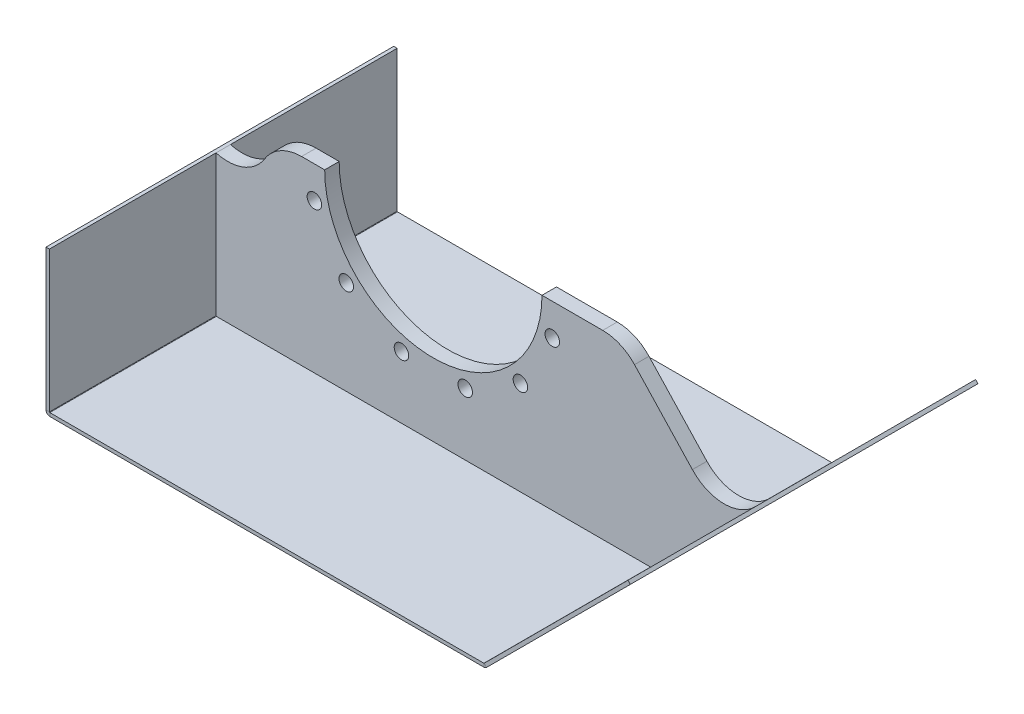
ISO-10303-21;
HEADER;
FILE_DESCRIPTION(('STEP AP214'),'2;1');
FILE_NAME('part.step','',(''),(''),'','','');
FILE_SCHEMA(('AUTOMOTIVE_DESIGN { 1 0 10303 214 1 1 1 1 }'));
ENDSEC;
DATA;
#1=APPLICATION_CONTEXT('core data for automotive mechanical design processes');
#2=APPLICATION_PROTOCOL_DEFINITION('international standard','automotive_design',2000,#1);
#3=PRODUCT_CONTEXT('',#1,'mechanical');
#4=PRODUCT('Part','Part','',(#3));
#5=PRODUCT_RELATED_PRODUCT_CATEGORY('part','',(#4));
#6=PRODUCT_DEFINITION_FORMATION('','',#4);
#7=PRODUCT_DEFINITION_CONTEXT('part definition',#1,'design');
#8=PRODUCT_DEFINITION('design','',#6,#7);
#9=PRODUCT_DEFINITION_SHAPE('','',#8);
#10=(LENGTH_UNIT() NAMED_UNIT(*) SI_UNIT(.MILLI.,.METRE.));
#11=(NAMED_UNIT(*) PLANE_ANGLE_UNIT() SI_UNIT($,.RADIAN.));
#12=(NAMED_UNIT(*) SI_UNIT($,.STERADIAN.) SOLID_ANGLE_UNIT());
#13=UNCERTAINTY_MEASURE_WITH_UNIT(LENGTH_MEASURE(1.E-05),#10,'distance_accuracy_value','');
#14=(GEOMETRIC_REPRESENTATION_CONTEXT(3) GLOBAL_UNCERTAINTY_ASSIGNED_CONTEXT((#13)) GLOBAL_UNIT_ASSIGNED_CONTEXT((#10,
#11,#12)) REPRESENTATION_CONTEXT('',''));
#15=CARTESIAN_POINT('',(0.,0.,0.));
#16=DIRECTION('',(0.,0.,1.));
#17=DIRECTION('',(1.,0.,0.));
#18=AXIS2_PLACEMENT_3D('',#15,#16,#17);
#19=CARTESIAN_POINT('',(0.,0.,25.4));
#20=DIRECTION('',(0.,0.,1.));
#21=DIRECTION('',(1.,0.,0.));
#22=AXIS2_PLACEMENT_3D('',#19,#20,#21);
#23=PLANE('',#22);
#24=CARTESIAN_POINT('',(-152.664354058159,-152.66435405818,25.4));
#25=DIRECTION('',(0.,0.,1.));
#26=DIRECTION('',(1.,0.,0.));
#27=AXIS2_PLACEMENT_3D('',#24,#25,#26);
#28=CIRCLE('',#27,12.7);
#29=CARTESIAN_POINT('',(-139.964354058159,-152.66435405818,25.4));
#30=VERTEX_POINT('',#29);
#31=EDGE_CURVE('E295',#30,#30,#28,.T.);
#32=ORIENTED_EDGE('',*,*,#31,.F.);
#33=EDGE_LOOP('',(#32));
#34=FACE_BOUND('',#33,.T.);
#35=CARTESIAN_POINT('',(55.8790318376513,-208.543385895805,25.4));
#36=DIRECTION('',(0.,0.,1.));
#37=DIRECTION('',(1.,0.,0.));
#38=AXIS2_PLACEMENT_3D('',#35,#36,#37);
#39=CIRCLE('',#38,12.7);
#40=CARTESIAN_POINT('',(68.5790318376513,-208.543385895805,25.4));
#41=VERTEX_POINT('',#40);
#42=EDGE_CURVE('E307',#41,#41,#39,.T.);
#43=ORIENTED_EDGE('',*,*,#42,.F.);
#44=EDGE_LOOP('',(#43));
#45=FACE_BOUND('',#44,.T.);
#46=CARTESIAN_POINT('',(208.543385895819,-55.8790318376252,25.4));
#47=DIRECTION('',(0.,0.,1.));
#48=DIRECTION('',(1.,0.,0.));
#49=AXIS2_PLACEMENT_3D('',#46,#47,#48);
#50=CIRCLE('',#49,12.7);
#51=CARTESIAN_POINT('',(221.243385895819,-55.8790318376252,25.4));
#52=VERTEX_POINT('',#51);
#53=EDGE_CURVE('E230',#52,#52,#50,.T.);
#54=ORIENTED_EDGE('',*,*,#53,.F.);
#55=EDGE_LOOP('',(#54));
#56=FACE_BOUND('',#55,.T.);
#57=CARTESIAN_POINT('',(152.664354058189,-152.664354058168,25.4));
#58=DIRECTION('',(0.,0.,1.));
#59=DIRECTION('',(1.,0.,0.));
#60=AXIS2_PLACEMENT_3D('',#57,#58,#59);
#61=CIRCLE('',#60,12.7);
#62=CARTESIAN_POINT('',(165.364354058189,-152.664354058168,25.4));
#63=VERTEX_POINT('',#62);
#64=EDGE_CURVE('E313',#63,#63,#61,.T.);
#65=ORIENTED_EDGE('',*,*,#64,.F.);
#66=EDGE_LOOP('',(#65));
#67=FACE_BOUND('',#66,.T.);
#68=CARTESIAN_POINT('',(-55.879031837616,-208.54338589581,25.4));
#69=DIRECTION('',(0.,0.,1.));
#70=DIRECTION('',(1.,0.,0.));
#71=AXIS2_PLACEMENT_3D('',#68,#69,#70);
#72=CIRCLE('',#71,12.7);
#73=CARTESIAN_POINT('',(-43.179031837616,-208.54338589581,25.4));
#74=VERTEX_POINT('',#73);
#75=EDGE_CURVE('E301',#74,#74,#72,.T.);
#76=ORIENTED_EDGE('',*,*,#75,.F.);
#77=EDGE_LOOP('',(#76));
#78=FACE_BOUND('',#77,.T.);
#79=CARTESIAN_POINT('',(-208.543385895796,-55.8790318376421,25.4));
#80=DIRECTION('',(0.,0.,1.));
#81=DIRECTION('',(1.,0.,0.));
#82=AXIS2_PLACEMENT_3D('',#79,#80,#81);
#83=CIRCLE('',#82,12.7);
#84=CARTESIAN_POINT('',(-195.843385895796,-55.8790318376421,25.4));
#85=VERTEX_POINT('',#84);
#86=EDGE_CURVE('E289',#85,#85,#83,.T.);
#87=ORIENTED_EDGE('',*,*,#86,.F.);
#88=EDGE_LOOP('',(#87));
#89=FACE_BOUND('',#88,.T.);
#90=DIRECTION('',(1.,0.,0.));
#91=VECTOR('',#90,1.);
#92=CARTESIAN_POINT('',(0.,0.,25.4));
#93=LINE('',#92,#91);
#94=CARTESIAN_POINT('',(-230.964431893917,0.,25.4));
#95=VERTEX_POINT('',#94);
#96=CARTESIAN_POINT('',(-190.5,0.,25.4));
#97=VERTEX_POINT('',#96);
#98=EDGE_CURVE('E376',#95,#97,#93,.T.);
#99=ORIENTED_EDGE('',*,*,#98,.F.);
#100=CARTESIAN_POINT('',(-230.964431893917,-76.2,25.4));
#101=DIRECTION('',(0.,0.,1.));
#102=DIRECTION('',(1.,0.,0.));
#103=AXIS2_PLACEMENT_3D('',#100,#101,#102);
#104=CIRCLE('',#103,76.2);
#105=CARTESIAN_POINT('',(-295.784522163989,-36.1400961386608,25.4));
#106=VERTEX_POINT('',#105);
#107=EDGE_CURVE('E259',#95,#106,#104,.T.);
#108=ORIENTED_EDGE('',*,*,#107,.T.);
#109=CARTESIAN_POINT('',(-360.60461243406,3.9198077226785,25.4));
#110=DIRECTION('',(0.,0.,1.));
#111=DIRECTION('',(1.,0.,0.));
#112=AXIS2_PLACEMENT_3D('',#109,#110,#111);
#113=CIRCLE('',#112,76.2);
#114=CARTESIAN_POINT('',(-381.000000000001,-69.5,25.4));
#115=VERTEX_POINT('',#114);
#116=EDGE_CURVE('E246',#106,#115,#113,.F.);
#117=ORIENTED_EDGE('',*,*,#116,.T.);
#118=DIRECTION('',(0.,1.,0.));
#119=VECTOR('',#118,1.);
#120=CARTESIAN_POINT('',(-381.,0.,25.4));
#121=LINE('',#120,#119);
#122=CARTESIAN_POINT('',(-381.,-316.7634,25.4));
#123=VERTEX_POINT('',#122);
#124=EDGE_CURVE('E280',#123,#115,#121,.T.);
#125=ORIENTED_EDGE('',*,*,#124,.F.);
#126=CARTESIAN_POINT('',(-380.2634,-316.7634,25.4));
#127=DIRECTION('',(0.,0.,1.));
#128=DIRECTION('',(1.,0.,0.));
#129=AXIS2_PLACEMENT_3D('',#126,#127,#128);
#130=CIRCLE('',#129,0.736599999999976);
#131=CARTESIAN_POINT('',(-380.2634,-317.5,25.4));
#132=VERTEX_POINT('',#131);
#133=EDGE_CURVE('E518',#123,#132,#130,.T.);
#134=ORIENTED_EDGE('',*,*,#133,.T.);
#135=DIRECTION('',(-1.,0.,0.));
#136=VECTOR('',#135,1.);
#137=CARTESIAN_POINT('',(0.,-317.5,25.4));
#138=LINE('',#137,#136);
#139=CARTESIAN_POINT('',(380.694890289956,-317.5,25.3999999999998));
#140=VERTEX_POINT('',#139);
#141=EDGE_CURVE('E277',#140,#132,#138,.T.);
#142=ORIENTED_EDGE('',*,*,#141,.F.);
#143=CARTESIAN_POINT('',(380.694890289956,-316.7634,25.4));
#144=DIRECTION('',(0.,0.,1.));
#145=DIRECTION('',(1.,0.,0.));
#146=AXIS2_PLACEMENT_3D('',#143,#144,#145);
#147=CIRCLE('',#146,0.736600000000042);
#148=CARTESIAN_POINT('',(381.215745144978,-317.284254855022,25.3999999999999));
#149=VERTEX_POINT('',#148);
#150=EDGE_CURVE('E513',#140,#149,#147,.T.);
#151=ORIENTED_EDGE('',*,*,#150,.T.);
#152=DIRECTION('',(-0.707106781186551,-0.707106781186544,0.));
#153=VECTOR('',#152,1.);
#154=CARTESIAN_POINT('',(349.249999999998,-349.250000000002,25.4));
#155=LINE('',#154,#153);
#156=CARTESIAN_POINT('',(563.760699338223,-134.739300661779,25.4));
#157=VERTEX_POINT('',#156);
#158=EDGE_CURVE('E509',#157,#149,#155,.T.);
#159=ORIENTED_EDGE('',*,*,#158,.F.);
#160=CARTESIAN_POINT('',(509.879162611808,-80.857763935364,25.4));
#161=DIRECTION('',(0.,0.,1.));
#162=DIRECTION('',(1.,0.,0.));
#163=AXIS2_PLACEMENT_3D('',#160,#161,#162);
#164=CIRCLE('',#163,76.2);
#165=CARTESIAN_POINT('',(454.18285844208,-132.861241721307,25.4));
#166=VERTEX_POINT('',#165);
#167=EDGE_CURVE('E251',#157,#166,#164,.F.);
#168=ORIENTED_EDGE('',*,*,#167,.T.);
#169=DIRECTION('',(0.682460338398204,-0.730922626899325,0.));
#170=VECTOR('',#169,1.);
#171=CARTESIAN_POINT('',(176.371629870807,164.677679655487,25.4));
#172=LINE('',#171,#170);
#173=CARTESIAN_POINT('',(352.72292476694,-24.1965222140569,25.4));
#174=VERTEX_POINT('',#173);
#175=EDGE_CURVE('E270',#174,#166,#172,.T.);
#176=ORIENTED_EDGE('',*,*,#175,.F.);
#177=CARTESIAN_POINT('',(297.026620597212,-76.2,25.4));
#178=DIRECTION('',(0.,0.,1.));
#179=DIRECTION('',(1.,0.,0.));
#180=AXIS2_PLACEMENT_3D('',#177,#178,#179);
#181=CIRCLE('',#180,76.2);
#182=CARTESIAN_POINT('',(297.026620597212,0.,25.4));
#183=VERTEX_POINT('',#182);
#184=EDGE_CURVE('E257',#174,#183,#181,.T.);
#185=ORIENTED_EDGE('',*,*,#184,.T.);
#186=DIRECTION('',(-1.,0.,0.));
#187=VECTOR('',#186,1.);
#188=CARTESIAN_POINT('',(0.,0.,25.4));
#189=LINE('',#188,#187);
#190=CARTESIAN_POINT('',(190.5,0.,25.4));
#191=VERTEX_POINT('',#190);
#192=EDGE_CURVE('E373',#183,#191,#189,.T.);
#193=ORIENTED_EDGE('',*,*,#192,.T.);
#194=CARTESIAN_POINT('',(0.,0.,25.4));
#195=DIRECTION('',(0.,0.,1.));
#196=DIRECTION('',(1.,0.,0.));
#197=AXIS2_PLACEMENT_3D('',#194,#195,#196);
#198=CIRCLE('',#197,190.5);
#199=EDGE_CURVE('E223',#97,#191,#198,.T.);
#200=ORIENTED_EDGE('',*,*,#199,.F.);
#201=EDGE_LOOP('',(#99,#108,#117,#125,#134,#142,#151,#159,#168,#176,#185,#193,#200));
#202=FACE_BOUND('',#201,.T.);
#203=ADVANCED_FACE('F45',(#34,#45,#56,#67,#78,#89,#202),#23,.T.);
#204=CARTESIAN_POINT('',(0.,0.,0.));
#205=DIRECTION('',(0.,0.,1.));
#206=DIRECTION('',(1.,0.,0.));
#207=AXIS2_PLACEMENT_3D('',#204,#205,#206);
#208=PLANE('',#207);
#209=CARTESIAN_POINT('',(-208.543385895796,-55.8790318376421,0.));
#210=DIRECTION('',(0.,0.,1.));
#211=DIRECTION('',(1.,0.,0.));
#212=AXIS2_PLACEMENT_3D('',#209,#210,#211);
#213=CIRCLE('',#212,12.7);
#214=CARTESIAN_POINT('',(-195.843385895796,-55.8790318376421,0.));
#215=VERTEX_POINT('',#214);
#216=EDGE_CURVE('E288',#215,#215,#213,.T.);
#217=ORIENTED_EDGE('',*,*,#216,.T.);
#218=EDGE_LOOP('',(#217));
#219=FACE_BOUND('',#218,.T.);
#220=CARTESIAN_POINT('',(-152.664354058159,-152.66435405818,0.));
#221=DIRECTION('',(0.,0.,1.));
#222=DIRECTION('',(1.,0.,0.));
#223=AXIS2_PLACEMENT_3D('',#220,#221,#222);
#224=CIRCLE('',#223,12.7);
#225=CARTESIAN_POINT('',(-139.964354058159,-152.66435405818,0.));
#226=VERTEX_POINT('',#225);
#227=EDGE_CURVE('E292',#226,#226,#224,.T.);
#228=ORIENTED_EDGE('',*,*,#227,.T.);
#229=EDGE_LOOP('',(#228));
#230=FACE_BOUND('',#229,.T.);
#231=CARTESIAN_POINT('',(-55.879031837616,-208.54338589581,0.));
#232=DIRECTION('',(0.,0.,1.));
#233=DIRECTION('',(1.,0.,0.));
#234=AXIS2_PLACEMENT_3D('',#231,#232,#233);
#235=CIRCLE('',#234,12.7);
#236=CARTESIAN_POINT('',(-43.179031837616,-208.54338589581,0.));
#237=VERTEX_POINT('',#236);
#238=EDGE_CURVE('E298',#237,#237,#235,.T.);
#239=ORIENTED_EDGE('',*,*,#238,.T.);
#240=EDGE_LOOP('',(#239));
#241=FACE_BOUND('',#240,.T.);
#242=CARTESIAN_POINT('',(55.8790318376513,-208.543385895805,0.));
#243=DIRECTION('',(0.,0.,1.));
#244=DIRECTION('',(1.,0.,0.));
#245=AXIS2_PLACEMENT_3D('',#242,#243,#244);
#246=CIRCLE('',#245,12.7);
#247=CARTESIAN_POINT('',(68.5790318376513,-208.543385895805,0.));
#248=VERTEX_POINT('',#247);
#249=EDGE_CURVE('E304',#248,#248,#246,.T.);
#250=ORIENTED_EDGE('',*,*,#249,.T.);
#251=EDGE_LOOP('',(#250));
#252=FACE_BOUND('',#251,.T.);
#253=CARTESIAN_POINT('',(152.664354058189,-152.664354058168,0.));
#254=DIRECTION('',(0.,0.,1.));
#255=DIRECTION('',(1.,0.,0.));
#256=AXIS2_PLACEMENT_3D('',#253,#254,#255);
#257=CIRCLE('',#256,12.7);
#258=CARTESIAN_POINT('',(165.364354058189,-152.664354058168,0.));
#259=VERTEX_POINT('',#258);
#260=EDGE_CURVE('E310',#259,#259,#257,.T.);
#261=ORIENTED_EDGE('',*,*,#260,.T.);
#262=EDGE_LOOP('',(#261));
#263=FACE_BOUND('',#262,.T.);
#264=CARTESIAN_POINT('',(208.543385895819,-55.8790318376252,0.));
#265=DIRECTION('',(0.,0.,1.));
#266=DIRECTION('',(1.,0.,0.));
#267=AXIS2_PLACEMENT_3D('',#264,#265,#266);
#268=CIRCLE('',#267,12.7);
#269=CARTESIAN_POINT('',(221.243385895819,-55.8790318376252,0.));
#270=VERTEX_POINT('',#269);
#271=EDGE_CURVE('E235',#270,#270,#268,.T.);
#272=ORIENTED_EDGE('',*,*,#271,.T.);
#273=EDGE_LOOP('',(#272));
#274=FACE_BOUND('',#273,.T.);
#275=CARTESIAN_POINT('',(-360.60461243406,3.9198077226785,0.));
#276=DIRECTION('',(0.,0.,1.));
#277=DIRECTION('',(1.,0.,0.));
#278=AXIS2_PLACEMENT_3D('',#275,#276,#277);
#279=CIRCLE('',#278,76.2);
#280=CARTESIAN_POINT('',(-381.000000000001,-69.5,0.));
#281=VERTEX_POINT('',#280);
#282=CARTESIAN_POINT('',(-295.784522163989,-36.1400961386608,0.));
#283=VERTEX_POINT('',#282);
#284=EDGE_CURVE('E244',#281,#283,#279,.T.);
#285=ORIENTED_EDGE('',*,*,#284,.T.);
#286=CARTESIAN_POINT('',(-230.964431893917,-76.2,0.));
#287=DIRECTION('',(0.,0.,1.));
#288=DIRECTION('',(1.,0.,0.));
#289=AXIS2_PLACEMENT_3D('',#286,#287,#288);
#290=CIRCLE('',#289,76.2);
#291=CARTESIAN_POINT('',(-230.964431893917,0.,0.));
#292=VERTEX_POINT('',#291);
#293=EDGE_CURVE('E264',#283,#292,#290,.F.);
#294=ORIENTED_EDGE('',*,*,#293,.T.);
#295=DIRECTION('',(-1.,0.,0.));
#296=VECTOR('',#295,1.);
#297=CARTESIAN_POINT('',(0.,0.,0.));
#298=LINE('',#297,#296);
#299=CARTESIAN_POINT('',(-190.5,0.,0.));
#300=VERTEX_POINT('',#299);
#301=EDGE_CURVE('E215',#300,#292,#298,.T.);
#302=ORIENTED_EDGE('',*,*,#301,.F.);
#303=CARTESIAN_POINT('',(0.,0.,0.));
#304=DIRECTION('',(0.,0.,1.));
#305=DIRECTION('',(1.,0.,0.));
#306=AXIS2_PLACEMENT_3D('',#303,#304,#305);
#307=CIRCLE('',#306,190.5);
#308=CARTESIAN_POINT('',(190.5,0.,0.));
#309=VERTEX_POINT('',#308);
#310=EDGE_CURVE('E221',#300,#309,#307,.T.);
#311=ORIENTED_EDGE('',*,*,#310,.T.);
#312=DIRECTION('',(1.,0.,0.));
#313=VECTOR('',#312,1.);
#314=CARTESIAN_POINT('',(0.,0.,0.));
#315=LINE('',#314,#313);
#316=CARTESIAN_POINT('',(297.026620597212,0.,0.));
#317=VERTEX_POINT('',#316);
#318=EDGE_CURVE('E209',#309,#317,#315,.T.);
#319=ORIENTED_EDGE('',*,*,#318,.T.);
#320=CARTESIAN_POINT('',(297.026620597212,-76.2,0.));
#321=DIRECTION('',(0.,0.,1.));
#322=DIRECTION('',(1.,0.,0.));
#323=AXIS2_PLACEMENT_3D('',#320,#321,#322);
#324=CIRCLE('',#323,76.2);
#325=CARTESIAN_POINT('',(352.72292476694,-24.1965222140569,0.));
#326=VERTEX_POINT('',#325);
#327=EDGE_CURVE('E60',#317,#326,#324,.F.);
#328=ORIENTED_EDGE('',*,*,#327,.T.);
#329=DIRECTION('',(0.682460338398204,-0.730922626899325,0.));
#330=VECTOR('',#329,1.);
#331=CARTESIAN_POINT('',(176.371629870807,164.677679655487,0.));
#332=LINE('',#331,#330);
#333=CARTESIAN_POINT('',(454.18285844208,-132.861241721307,0.));
#334=VERTEX_POINT('',#333);
#335=EDGE_CURVE('E271',#326,#334,#332,.T.);
#336=ORIENTED_EDGE('',*,*,#335,.T.);
#337=CARTESIAN_POINT('',(509.879162611808,-80.857763935364,0.));
#338=DIRECTION('',(0.,0.,1.));
#339=DIRECTION('',(1.,0.,0.));
#340=AXIS2_PLACEMENT_3D('',#337,#338,#339);
#341=CIRCLE('',#340,76.2);
#342=CARTESIAN_POINT('',(563.760699338223,-134.739300661779,0.));
#343=VERTEX_POINT('',#342);
#344=EDGE_CURVE('E248',#334,#343,#341,.T.);
#345=ORIENTED_EDGE('',*,*,#344,.T.);
#346=DIRECTION('',(-0.707106781186551,-0.707106781186544,0.));
#347=VECTOR('',#346,1.);
#348=CARTESIAN_POINT('',(349.249999999998,-349.250000000002,0.));
#349=LINE('',#348,#347);
#350=CARTESIAN_POINT('',(381.215745144978,-317.284254855022,-1.11022302462516E-13));
#351=VERTEX_POINT('',#350);
#352=EDGE_CURVE('E502',#343,#351,#349,.T.);
#353=ORIENTED_EDGE('',*,*,#352,.T.);
#354=CARTESIAN_POINT('',(380.694890289956,-316.7634,0.));
#355=DIRECTION('',(0.,0.,1.));
#356=DIRECTION('',(1.,0.,0.));
#357=AXIS2_PLACEMENT_3D('',#354,#355,#356);
#358=CIRCLE('',#357,0.736600000000042);
#359=CARTESIAN_POINT('',(380.694890289956,-317.5,-2.22044604925031E-13));
#360=VERTEX_POINT('',#359);
#361=EDGE_CURVE('E511',#360,#351,#358,.T.);
#362=ORIENTED_EDGE('',*,*,#361,.F.);
#363=DIRECTION('',(-1.,0.,0.));
#364=VECTOR('',#363,1.);
#365=CARTESIAN_POINT('',(0.,-317.5,0.));
#366=LINE('',#365,#364);
#367=CARTESIAN_POINT('',(-380.2634,-317.5,0.));
#368=VERTEX_POINT('',#367);
#369=EDGE_CURVE('E282',#360,#368,#366,.T.);
#370=ORIENTED_EDGE('',*,*,#369,.T.);
#371=CARTESIAN_POINT('',(-380.2634,-316.7634,0.));
#372=DIRECTION('',(0.,0.,1.));
#373=DIRECTION('',(1.,0.,0.));
#374=AXIS2_PLACEMENT_3D('',#371,#372,#373);
#375=CIRCLE('',#374,0.736599999999976);
#376=CARTESIAN_POINT('',(-381.,-316.7634,0.));
#377=VERTEX_POINT('',#376);
#378=EDGE_CURVE('E516',#377,#368,#375,.T.);
#379=ORIENTED_EDGE('',*,*,#378,.F.);
#380=DIRECTION('',(0.,1.,0.));
#381=VECTOR('',#380,1.);
#382=CARTESIAN_POINT('',(-381.,0.,0.));
#383=LINE('',#382,#381);
#384=EDGE_CURVE('E278',#377,#281,#383,.T.);
#385=ORIENTED_EDGE('',*,*,#384,.T.);
#386=EDGE_LOOP('',(#285,#294,#302,#311,#319,#328,#336,#345,#353,#362,#370,#379,#385));
#387=FACE_BOUND('',#386,.T.);
#388=ADVANCED_FACE('F228',(#219,#230,#241,#252,#263,#274,#387),#208,.F.);
#389=CARTESIAN_POINT('',(0.,0.,25.4));
#390=DIRECTION('',(0.,0.,-1.));
#391=DIRECTION('',(-1.,0.,0.));
#392=AXIS2_PLACEMENT_3D('',#389,#390,#391);
#393=CYLINDRICAL_SURFACE('',#392,190.5);
#394=ORIENTED_EDGE('',*,*,#199,.T.);
#395=DIRECTION('',(0.,0.,-1.));
#396=VECTOR('',#395,1.);
#397=CARTESIAN_POINT('',(190.5,0.,317.5));
#398=LINE('',#397,#396);
#399=EDGE_CURVE('E212',#191,#309,#398,.T.);
#400=ORIENTED_EDGE('',*,*,#399,.T.);
#401=ORIENTED_EDGE('',*,*,#310,.F.);
#402=DIRECTION('',(0.,0.,-1.));
#403=VECTOR('',#402,1.);
#404=CARTESIAN_POINT('',(-190.5,0.,317.5));
#405=LINE('',#404,#403);
#406=EDGE_CURVE('E224',#97,#300,#405,.T.);
#407=ORIENTED_EDGE('',*,*,#406,.F.);
#408=EDGE_LOOP('',(#394,#400,#401,#407));
#409=FACE_BOUND('',#408,.T.);
#410=ADVANCED_FACE('F219',(#409),#393,.F.);
#411=CARTESIAN_POINT('',(176.371629870807,164.677679655487,25.4));
#412=DIRECTION('',(0.730922626899325,0.682460338398204,0.));
#413=DIRECTION('',(-0.682460338398204,0.730922626899325,0.));
#414=AXIS2_PLACEMENT_3D('',#411,#412,#413);
#415=PLANE('',#414);
#416=ORIENTED_EDGE('',*,*,#335,.F.);
#417=DIRECTION('',(0.,0.,1.));
#418=VECTOR('',#417,1.);
#419=CARTESIAN_POINT('',(352.72292476694,-24.1965222140568,25.4));
#420=LINE('',#419,#418);
#421=EDGE_CURVE('E53',#326,#174,#420,.T.);
#422=ORIENTED_EDGE('',*,*,#421,.T.);
#423=ORIENTED_EDGE('',*,*,#175,.T.);
#424=DIRECTION('',(0.,0.,-1.));
#425=VECTOR('',#424,1.);
#426=CARTESIAN_POINT('',(454.18285844208,-132.861241721307,0.));
#427=LINE('',#426,#425);
#428=EDGE_CURVE('E232',#166,#334,#427,.T.);
#429=ORIENTED_EDGE('',*,*,#428,.T.);
#430=EDGE_LOOP('',(#416,#422,#423,#429));
#431=FACE_BOUND('',#430,.T.);
#432=ADVANCED_FACE('F269',(#431),#415,.T.);
#433=CARTESIAN_POINT('',(-381.000000000001,-1.36449991091028E-12,0.));
#434=DIRECTION('',(1.,0.,0.));
#435=DIRECTION('',(0.,1.,0.));
#436=AXIS2_PLACEMENT_3D('',#433,#434,#435);
#437=PLANE('',#436);
#438=DIRECTION('',(0.,0.,-1.));
#439=VECTOR('',#438,1.);
#440=CARTESIAN_POINT('',(-381.000000000001,-69.5,-292.1));
#441=LINE('',#440,#439);
#442=CARTESIAN_POINT('',(-381.000000000001,-69.5,-292.1));
#443=VERTEX_POINT('',#442);
#444=EDGE_CURVE('E401',#281,#443,#441,.T.);
#445=ORIENTED_EDGE('',*,*,#444,.F.);
#446=ORIENTED_EDGE('',*,*,#384,.F.);
#447=DIRECTION('',(0.,0.,1.));
#448=VECTOR('',#447,1.);
#449=CARTESIAN_POINT('',(-381.,-316.7634,-292.1));
#450=LINE('',#449,#448);
#451=CARTESIAN_POINT('',(-381.,-316.7634,-292.1));
#452=VERTEX_POINT('',#451);
#453=EDGE_CURVE('E379',#452,#377,#450,.T.);
#454=ORIENTED_EDGE('',*,*,#453,.F.);
#455=DIRECTION('',(0.,-1.,0.));
#456=VECTOR('',#455,1.);
#457=CARTESIAN_POINT('',(-381.,-317.5,-292.1));
#458=LINE('',#457,#456);
#459=EDGE_CURVE('E394',#443,#452,#458,.T.);
#460=ORIENTED_EDGE('',*,*,#459,.F.);
#461=EDGE_LOOP('',(#445,#446,#454,#460));
#462=FACE_BOUND('',#461,.T.);
#463=ADVANCED_FACE('F608',(#462),#437,.T.);
#464=CARTESIAN_POINT('',(0.,-317.5,0.));
#465=DIRECTION('',(0.,-1.,0.));
#466=DIRECTION('',(0.,0.,-1.));
#467=AXIS2_PLACEMENT_3D('',#464,#465,#466);
#468=PLANE('',#467);
#469=DIRECTION('',(0.,0.,1.));
#470=VECTOR('',#469,1.);
#471=CARTESIAN_POINT('',(-380.2634,-317.5,317.5));
#472=LINE('',#471,#470);
#473=CARTESIAN_POINT('',(-380.2634,-317.5,-292.1));
#474=VERTEX_POINT('',#473);
#475=EDGE_CURVE('E430',#368,#474,#472,.F.);
#476=ORIENTED_EDGE('',*,*,#475,.F.);
#477=ORIENTED_EDGE('',*,*,#369,.F.);
#478=DIRECTION('',(0.,0.,-1.));
#479=VECTOR('',#478,1.);
#480=CARTESIAN_POINT('',(380.694890289956,-317.5,-292.1));
#481=LINE('',#480,#479);
#482=CARTESIAN_POINT('',(380.694890289956,-317.5,-292.1));
#483=VERTEX_POINT('',#482);
#484=EDGE_CURVE('E484',#483,#360,#481,.F.);
#485=ORIENTED_EDGE('',*,*,#484,.F.);
#486=DIRECTION('',(-1.,0.,0.));
#487=VECTOR('',#486,1.);
#488=CARTESIAN_POINT('',(-381.,-317.5,-292.1));
#489=LINE('',#488,#487);
#490=EDGE_CURVE('E493',#483,#474,#489,.T.);
#491=ORIENTED_EDGE('',*,*,#490,.T.);
#492=EDGE_LOOP('',(#476,#477,#485,#491));
#493=FACE_BOUND('',#492,.T.);
#494=ADVANCED_FACE('F527',(#493),#468,.F.);
#495=CARTESIAN_POINT('',(-380.2634,-316.7634,317.5));
#496=DIRECTION('',(0.,0.,1.));
#497=DIRECTION('',(-1.,0.,0.));
#498=AXIS2_PLACEMENT_3D('',#495,#496,#497);
#499=CYLINDRICAL_SURFACE('',#498,0.736599999999976);
#500=ORIENTED_EDGE('',*,*,#453,.T.);
#501=ORIENTED_EDGE('',*,*,#378,.T.);
#502=ORIENTED_EDGE('',*,*,#475,.T.);
#503=CARTESIAN_POINT('',(-380.2634,-316.7634,-292.1));
#504=DIRECTION('',(0.,0.,1.));
#505=DIRECTION('',(1.,0.,0.));
#506=AXIS2_PLACEMENT_3D('',#503,#504,#505);
#507=CIRCLE('',#506,0.736599999999976);
#508=EDGE_CURVE('E424',#474,#452,#507,.F.);
#509=ORIENTED_EDGE('',*,*,#508,.T.);
#510=EDGE_LOOP('',(#500,#501,#502,#509));
#511=FACE_BOUND('',#510,.T.);
#512=ADVANCED_FACE('F610',(#511),#499,.F.);
#513=CARTESIAN_POINT('',(380.694890289956,-316.7634,-292.1));
#514=DIRECTION('',(0.,0.,-1.));
#515=DIRECTION('',(0.707106781186544,-0.707106781186551,0.));
#516=AXIS2_PLACEMENT_3D('',#513,#514,#515);
#517=CYLINDRICAL_SURFACE('',#516,0.736600000000042);
#518=ORIENTED_EDGE('',*,*,#484,.T.);
#519=ORIENTED_EDGE('',*,*,#361,.T.);
#520=DIRECTION('',(0.,0.,-1.));
#521=VECTOR('',#520,1.);
#522=CARTESIAN_POINT('',(381.215745144978,-317.284254855022,317.5));
#523=LINE('',#522,#521);
#524=CARTESIAN_POINT('',(381.215745144978,-317.284254855022,-292.1));
#525=VERTEX_POINT('',#524);
#526=EDGE_CURVE('E443',#351,#525,#523,.T.);
#527=ORIENTED_EDGE('',*,*,#526,.T.);
#528=CARTESIAN_POINT('',(380.694890289956,-316.7634,-292.1));
#529=DIRECTION('',(0.,0.,-1.));
#530=DIRECTION('',(-1.,0.,0.));
#531=AXIS2_PLACEMENT_3D('',#528,#529,#530);
#532=CIRCLE('',#531,0.736600000000042);
#533=EDGE_CURVE('E470',#525,#483,#532,.T.);
#534=ORIENTED_EDGE('',*,*,#533,.T.);
#535=EDGE_LOOP('',(#518,#519,#527,#534));
#536=FACE_BOUND('',#535,.T.);
#537=ADVANCED_FACE('F530',(#536),#517,.F.);
#538=CARTESIAN_POINT('',(0.,-323.5,0.));
#539=DIRECTION('',(0.,-1.,0.));
#540=DIRECTION('',(0.,0.,-1.));
#541=AXIS2_PLACEMENT_3D('',#538,#539,#540);
#542=PLANE('',#541);
#543=DIRECTION('',(1.,0.,0.));
#544=VECTOR('',#543,1.);
#545=CARTESIAN_POINT('',(-381.,-323.5,317.5));
#546=LINE('',#545,#544);
#547=CARTESIAN_POINT('',(-380.2634,-323.5,317.5));
#548=VERTEX_POINT('',#547);
#549=CARTESIAN_POINT('',(380.694890289956,-323.5,317.5));
#550=VERTEX_POINT('',#549);
#551=EDGE_CURVE('E499',#548,#550,#546,.T.);
#552=ORIENTED_EDGE('',*,*,#551,.F.);
#553=DIRECTION('',(0.,0.,1.));
#554=VECTOR('',#553,1.);
#555=CARTESIAN_POINT('',(-380.2634,-323.5,317.5));
#556=LINE('',#555,#554);
#557=CARTESIAN_POINT('',(-380.2634,-323.5,-292.1));
#558=VERTEX_POINT('',#557);
#559=EDGE_CURVE('E414',#548,#558,#556,.F.);
#560=ORIENTED_EDGE('',*,*,#559,.T.);
#561=DIRECTION('',(-1.,0.,0.));
#562=VECTOR('',#561,1.);
#563=CARTESIAN_POINT('',(-381.,-323.5,-292.1));
#564=LINE('',#563,#562);
#565=CARTESIAN_POINT('',(380.694890289956,-323.5,-292.1));
#566=VERTEX_POINT('',#565);
#567=EDGE_CURVE('E496',#566,#558,#564,.T.);
#568=ORIENTED_EDGE('',*,*,#567,.F.);
#569=DIRECTION('',(0.,0.,-1.));
#570=VECTOR('',#569,1.);
#571=CARTESIAN_POINT('',(380.694890289956,-323.5,-292.1));
#572=LINE('',#571,#570);
#573=EDGE_CURVE('E471',#566,#550,#572,.F.);
#574=ORIENTED_EDGE('',*,*,#573,.T.);
#575=EDGE_LOOP('',(#552,#560,#568,#574));
#576=FACE_BOUND('',#575,.T.);
#577=ADVANCED_FACE('F568',(#576),#542,.T.);
#578=ORIENTED_EDGE('',*,*,#141,.T.);
#579=CARTESIAN_POINT('',(-380.2634,-317.5,317.5));
#580=VERTEX_POINT('',#579);
#581=EDGE_CURVE('E427',#580,#132,#472,.F.);
#582=ORIENTED_EDGE('',*,*,#581,.F.);
#583=DIRECTION('',(1.,0.,0.));
#584=VECTOR('',#583,1.);
#585=CARTESIAN_POINT('',(-381.,-317.5,317.5));
#586=LINE('',#585,#584);
#587=CARTESIAN_POINT('',(380.694890289956,-317.5,317.499999999999));
#588=VERTEX_POINT('',#587);
#589=EDGE_CURVE('E500',#580,#588,#586,.T.);
#590=ORIENTED_EDGE('',*,*,#589,.T.);
#591=EDGE_CURVE('E487',#140,#588,#481,.F.);
#592=ORIENTED_EDGE('',*,*,#591,.F.);
#593=EDGE_LOOP('',(#578,#582,#590,#592));
#594=FACE_BOUND('',#593,.T.);
#595=ADVANCED_FACE('F586',(#594),#468,.F.);
#596=CARTESIAN_POINT('',(-381.,-323.5,317.5));
#597=DIRECTION('',(0.,0.,1.));
#598=DIRECTION('',(1.,0.,0.));
#599=AXIS2_PLACEMENT_3D('',#596,#597,#598);
#600=PLANE('',#599);
#601=ORIENTED_EDGE('',*,*,#589,.F.);
#602=DIRECTION('',(0.,-1.,0.));
#603=VECTOR('',#602,1.);
#604=CARTESIAN_POINT('',(-380.2634,-317.5,317.5));
#605=LINE('',#604,#603);
#606=EDGE_CURVE('E421',#580,#548,#605,.T.);
#607=ORIENTED_EDGE('',*,*,#606,.T.);
#608=ORIENTED_EDGE('',*,*,#551,.T.);
#609=DIRECTION('',(0.,-1.,3.01445295852595E-13));
#610=VECTOR('',#609,1.);
#611=CARTESIAN_POINT('',(380.694890289956,-317.5,317.499999999999));
#612=LINE('',#611,#610);
#613=EDGE_CURVE('E490',#588,#550,#612,.T.);
#614=ORIENTED_EDGE('',*,*,#613,.F.);
#615=EDGE_LOOP('',(#601,#607,#608,#614));
#616=FACE_BOUND('',#615,.T.);
#617=ADVANCED_FACE('F582',(#616),#600,.T.);
#618=CARTESIAN_POINT('',(-381.,-323.5,-292.1));
#619=DIRECTION('',(0.,0.,-1.));
#620=DIRECTION('',(-1.,0.,0.));
#621=AXIS2_PLACEMENT_3D('',#618,#619,#620);
#622=PLANE('',#621);
#623=DIRECTION('',(0.,-1.,0.));
#624=VECTOR('',#623,1.);
#625=CARTESIAN_POINT('',(-380.2634,-317.5,-292.1));
#626=LINE('',#625,#624);
#627=EDGE_CURVE('E433',#474,#558,#626,.T.);
#628=ORIENTED_EDGE('',*,*,#627,.F.);
#629=ORIENTED_EDGE('',*,*,#490,.F.);
#630=DIRECTION('',(0.,-1.,0.));
#631=VECTOR('',#630,1.);
#632=CARTESIAN_POINT('',(380.694890289956,-317.5,-292.1));
#633=LINE('',#632,#631);
#634=EDGE_CURVE('E478',#483,#566,#633,.T.);
#635=ORIENTED_EDGE('',*,*,#634,.T.);
#636=ORIENTED_EDGE('',*,*,#567,.T.);
#637=EDGE_LOOP('',(#628,#629,#635,#636));
#638=FACE_BOUND('',#637,.T.);
#639=ADVANCED_FACE('F571',(#638),#622,.T.);
#640=CARTESIAN_POINT('',(380.694890289956,-316.7634,317.5));
#641=DIRECTION('',(0.,0.,1.));
#642=DIRECTION('',(1.,0.,0.));
#643=AXIS2_PLACEMENT_3D('',#640,#641,#642);
#644=PLANE('',#643);
#645=DIRECTION('',(0.707106781186544,-0.707106781186551,0.));
#646=VECTOR('',#645,1.);
#647=CARTESIAN_POINT('',(381.215745144978,-317.284254855022,317.5));
#648=LINE('',#647,#646);
#649=CARTESIAN_POINT('',(381.215745144978,-317.284254855022,317.499999999999));
#650=VERTEX_POINT('',#649);
#651=CARTESIAN_POINT('',(385.458385832097,-321.526895542142,317.499999999999));
#652=VERTEX_POINT('',#651);
#653=EDGE_CURVE('E436',#650,#652,#648,.T.);
#654=ORIENTED_EDGE('',*,*,#653,.F.);
#655=CARTESIAN_POINT('',(380.694890289956,-316.7634,317.5));
#656=DIRECTION('',(0.,0.,-1.));
#657=DIRECTION('',(-1.,0.,0.));
#658=AXIS2_PLACEMENT_3D('',#655,#656,#657);
#659=CIRCLE('',#658,0.736600000000042);
#660=EDGE_CURVE('E481',#588,#650,#659,.F.);
#661=ORIENTED_EDGE('',*,*,#660,.F.);
#662=ORIENTED_EDGE('',*,*,#613,.T.);
#663=CARTESIAN_POINT('',(380.694890289956,-316.7634,317.499999999999));
#664=DIRECTION('',(0.,0.,-1.));
#665=DIRECTION('',(-1.,0.,0.));
#666=AXIS2_PLACEMENT_3D('',#663,#664,#665);
#667=CIRCLE('',#666,6.73660000000004);
#668=EDGE_CURVE('E474',#550,#652,#667,.F.);
#669=ORIENTED_EDGE('',*,*,#668,.T.);
#670=EDGE_LOOP('',(#654,#661,#662,#669));
#671=FACE_BOUND('',#670,.T.);
#672=ADVANCED_FACE('F560',(#671),#644,.T.);
#673=CARTESIAN_POINT('',(380.694890289956,-316.7634,-292.1));
#674=DIRECTION('',(0.,0.,1.));
#675=DIRECTION('',(1.,0.,0.));
#676=AXIS2_PLACEMENT_3D('',#673,#674,#675);
#677=PLANE('',#676);
#678=ORIENTED_EDGE('',*,*,#533,.F.);
#679=DIRECTION('',(0.707106781186544,-0.707106781186551,0.));
#680=VECTOR('',#679,1.);
#681=CARTESIAN_POINT('',(381.215745144978,-317.284254855022,-292.1));
#682=LINE('',#681,#680);
#683=CARTESIAN_POINT('',(385.458385832097,-321.526895542141,-292.1));
#684=VERTEX_POINT('',#683);
#685=EDGE_CURVE('E442',#525,#684,#682,.T.);
#686=ORIENTED_EDGE('',*,*,#685,.T.);
#687=CARTESIAN_POINT('',(380.694890289956,-316.7634,-292.1));
#688=DIRECTION('',(0.,0.,-1.));
#689=DIRECTION('',(-1.,0.,0.));
#690=AXIS2_PLACEMENT_3D('',#687,#688,#689);
#691=CIRCLE('',#690,6.73660000000004);
#692=EDGE_CURVE('E475',#684,#566,#691,.T.);
#693=ORIENTED_EDGE('',*,*,#692,.T.);
#694=ORIENTED_EDGE('',*,*,#634,.F.);
#695=EDGE_LOOP('',(#678,#686,#693,#694));
#696=FACE_BOUND('',#695,.T.);
#697=ADVANCED_FACE('F535',(#696),#677,.F.);
#698=CARTESIAN_POINT('',(380.694890289956,-316.7634,-292.1));
#699=DIRECTION('',(0.,0.,-1.));
#700=DIRECTION('',(0.707106781186544,-0.707106781186551,0.));
#701=AXIS2_PLACEMENT_3D('',#698,#699,#700);
#702=CYLINDRICAL_SURFACE('',#701,6.73660000000004);
#703=ORIENTED_EDGE('',*,*,#573,.F.);
#704=ORIENTED_EDGE('',*,*,#692,.F.);
#705=DIRECTION('',(0.,0.,1.));
#706=VECTOR('',#705,1.);
#707=CARTESIAN_POINT('',(385.458385832097,-321.526895542141,0.));
#708=LINE('',#707,#706);
#709=EDGE_CURVE('E446',#684,#652,#708,.T.);
#710=ORIENTED_EDGE('',*,*,#709,.T.);
#711=ORIENTED_EDGE('',*,*,#668,.F.);
#712=EDGE_LOOP('',(#703,#704,#710,#711));
#713=FACE_BOUND('',#712,.T.);
#714=ADVANCED_FACE('F558',(#713),#702,.T.);
#715=ORIENTED_EDGE('',*,*,#150,.F.);
#716=ORIENTED_EDGE('',*,*,#591,.T.);
#717=ORIENTED_EDGE('',*,*,#660,.T.);
#718=EDGE_CURVE('E439',#650,#149,#523,.T.);
#719=ORIENTED_EDGE('',*,*,#718,.T.);
#720=EDGE_LOOP('',(#715,#716,#717,#719));
#721=FACE_BOUND('',#720,.T.);
#722=ADVANCED_FACE('F618',(#721),#517,.F.);
#723=CARTESIAN_POINT('',(637.446924478076,-69.5383568961656,-292.1));
#724=DIRECTION('',(0.,0.,1.));
#725=DIRECTION('',(1.,0.,0.));
#726=AXIS2_PLACEMENT_3D('',#723,#724,#725);
#727=PLANE('',#726);
#728=ORIENTED_EDGE('',*,*,#685,.F.);
#729=DIRECTION('',(0.707106781186551,0.707106781186544,0.));
#730=VECTOR('',#729,1.);
#731=CARTESIAN_POINT('',(633.204283790956,-65.2957162090463,-292.1));
#732=LINE('',#731,#730);
#733=CARTESIAN_POINT('',(633.204283790956,-65.2957162090463,-292.1));
#734=VERTEX_POINT('',#733);
#735=EDGE_CURVE('E450',#525,#734,#732,.T.);
#736=ORIENTED_EDGE('',*,*,#735,.T.);
#737=DIRECTION('',(-0.707106781186544,0.707106781186551,0.));
#738=VECTOR('',#737,1.);
#739=CARTESIAN_POINT('',(637.446924478076,-69.5383568961656,-292.1));
#740=LINE('',#739,#738);
#741=CARTESIAN_POINT('',(637.446924478076,-69.5383568961656,-292.1));
#742=VERTEX_POINT('',#741);
#743=EDGE_CURVE('E467',#742,#734,#740,.T.);
#744=ORIENTED_EDGE('',*,*,#743,.F.);
#745=DIRECTION('',(0.707106781186551,0.707106781186544,0.));
#746=VECTOR('',#745,1.);
#747=CARTESIAN_POINT('',(637.446924478076,-69.5383568961656,-292.1));
#748=LINE('',#747,#746);
#749=EDGE_CURVE('E451',#684,#742,#748,.T.);
#750=ORIENTED_EDGE('',*,*,#749,.F.);
#751=EDGE_LOOP('',(#728,#736,#744,#750));
#752=FACE_BOUND('',#751,.T.);
#753=ADVANCED_FACE('F540',(#752),#727,.F.);
#754=CARTESIAN_POINT('',(385.242640687119,-321.742640687119,317.5));
#755=DIRECTION('',(0.,0.,-1.));
#756=DIRECTION('',(-1.,0.,0.));
#757=AXIS2_PLACEMENT_3D('',#754,#755,#756);
#758=PLANE('',#757);
#759=ORIENTED_EDGE('',*,*,#653,.T.);
#760=DIRECTION('',(-0.707106781186551,-0.707106781186544,0.));
#761=VECTOR('',#760,1.);
#762=CARTESIAN_POINT('',(385.242640687119,-321.742640687119,317.5));
#763=LINE('',#762,#761);
#764=CARTESIAN_POINT('',(637.446924478076,-69.5383568961656,317.5));
#765=VERTEX_POINT('',#764);
#766=EDGE_CURVE('E456',#765,#652,#763,.T.);
#767=ORIENTED_EDGE('',*,*,#766,.F.);
#768=DIRECTION('',(-0.707106781186544,0.707106781186551,0.));
#769=VECTOR('',#768,1.);
#770=CARTESIAN_POINT('',(637.446924478076,-69.5383568961656,317.5));
#771=LINE('',#770,#769);
#772=CARTESIAN_POINT('',(633.204283790956,-65.2957162090463,317.5));
#773=VERTEX_POINT('',#772);
#774=EDGE_CURVE('E459',#765,#773,#771,.T.);
#775=ORIENTED_EDGE('',*,*,#774,.T.);
#776=DIRECTION('',(-0.707106781186551,-0.707106781186544,0.));
#777=VECTOR('',#776,1.);
#778=CARTESIAN_POINT('',(381.,-317.5,317.5));
#779=LINE('',#778,#777);
#780=EDGE_CURVE('E454',#773,#650,#779,.T.);
#781=ORIENTED_EDGE('',*,*,#780,.T.);
#782=EDGE_LOOP('',(#759,#767,#775,#781));
#783=FACE_BOUND('',#782,.T.);
#784=ADVANCED_FACE('F553',(#783),#758,.F.);
#785=CARTESIAN_POINT('',(353.492640687117,-353.492640687121,0.));
#786=DIRECTION('',(-0.707106781186544,0.707106781186551,0.));
#787=DIRECTION('',(-0.707106781186551,-0.707106781186544,0.));
#788=AXIS2_PLACEMENT_3D('',#785,#786,#787);
#789=PLANE('',#788);
#790=ORIENTED_EDGE('',*,*,#709,.F.);
#791=ORIENTED_EDGE('',*,*,#749,.T.);
#792=DIRECTION('',(0.,0.,1.));
#793=VECTOR('',#792,1.);
#794=CARTESIAN_POINT('',(637.446924478076,-69.5383568961656,317.5));
#795=LINE('',#794,#793);
#796=EDGE_CURVE('E453',#742,#765,#795,.T.);
#797=ORIENTED_EDGE('',*,*,#796,.T.);
#798=ORIENTED_EDGE('',*,*,#766,.T.);
#799=EDGE_LOOP('',(#790,#791,#797,#798));
#800=FACE_BOUND('',#799,.T.);
#801=ADVANCED_FACE('F555',(#800),#789,.F.);
#802=CARTESIAN_POINT('',(349.249999999998,-349.250000000002,0.));
#803=DIRECTION('',(-0.707106781186544,0.707106781186551,0.));
#804=DIRECTION('',(-0.707106781186551,-0.707106781186544,0.));
#805=AXIS2_PLACEMENT_3D('',#802,#803,#804);
#806=PLANE('',#805);
#807=ORIENTED_EDGE('',*,*,#352,.F.);
#808=DIRECTION('',(0.,0.,-1.));
#809=VECTOR('',#808,1.);
#810=CARTESIAN_POINT('',(563.760699338223,-134.739300661779,25.4));
#811=LINE('',#810,#809);
#812=EDGE_CURVE('E241',#343,#157,#811,.F.);
#813=ORIENTED_EDGE('',*,*,#812,.T.);
#814=ORIENTED_EDGE('',*,*,#158,.T.);
#815=ORIENTED_EDGE('',*,*,#718,.F.);
#816=ORIENTED_EDGE('',*,*,#780,.F.);
#817=DIRECTION('',(0.,0.,1.));
#818=VECTOR('',#817,1.);
#819=CARTESIAN_POINT('',(633.204283790956,-65.2957162090463,317.5));
#820=LINE('',#819,#818);
#821=EDGE_CURVE('E461',#734,#773,#820,.T.);
#822=ORIENTED_EDGE('',*,*,#821,.F.);
#823=ORIENTED_EDGE('',*,*,#735,.F.);
#824=ORIENTED_EDGE('',*,*,#526,.F.);
#825=EDGE_LOOP('',(#807,#813,#814,#815,#816,#822,#823,#824));
#826=FACE_BOUND('',#825,.T.);
#827=ADVANCED_FACE('F544',(#826),#806,.T.);
#828=CARTESIAN_POINT('',(637.446924478076,-69.5383568961656,317.5));
#829=DIRECTION('',(-0.707106781186551,-0.707106781186544,0.));
#830=DIRECTION('',(0.707106781186544,-0.707106781186551,0.));
#831=AXIS2_PLACEMENT_3D('',#828,#829,#830);
#832=PLANE('',#831);
#833=ORIENTED_EDGE('',*,*,#821,.T.);
#834=ORIENTED_EDGE('',*,*,#774,.F.);
#835=ORIENTED_EDGE('',*,*,#796,.F.);
#836=ORIENTED_EDGE('',*,*,#743,.T.);
#837=EDGE_LOOP('',(#833,#834,#835,#836));
#838=FACE_BOUND('',#837,.T.);
#839=ADVANCED_FACE('F549',(#838),#832,.F.);
#840=CARTESIAN_POINT('',(-380.2634,-316.7634,-292.1));
#841=DIRECTION('',(0.,0.,-1.));
#842=DIRECTION('',(-1.,0.,0.));
#843=AXIS2_PLACEMENT_3D('',#840,#841,#842);
#844=PLANE('',#843);
#845=DIRECTION('',(-1.,0.,0.));
#846=VECTOR('',#845,1.);
#847=CARTESIAN_POINT('',(-381.,-316.7634,-292.1));
#848=LINE('',#847,#846);
#849=CARTESIAN_POINT('',(-387.,-316.7634,-292.1));
#850=VERTEX_POINT('',#849);
#851=EDGE_CURVE('E378',#452,#850,#848,.T.);
#852=ORIENTED_EDGE('',*,*,#851,.F.);
#853=ORIENTED_EDGE('',*,*,#508,.F.);
#854=ORIENTED_EDGE('',*,*,#627,.T.);
#855=CARTESIAN_POINT('',(-380.2634,-316.7634,-292.1));
#856=DIRECTION('',(0.,0.,1.));
#857=DIRECTION('',(1.,0.,0.));
#858=AXIS2_PLACEMENT_3D('',#855,#856,#857);
#859=CIRCLE('',#858,6.73659999999998);
#860=EDGE_CURVE('E417',#558,#850,#859,.F.);
#861=ORIENTED_EDGE('',*,*,#860,.T.);
#862=EDGE_LOOP('',(#852,#853,#854,#861));
#863=FACE_BOUND('',#862,.T.);
#864=ADVANCED_FACE('F574',(#863),#844,.T.);
#865=CARTESIAN_POINT('',(-380.2634,-316.7634,317.5));
#866=DIRECTION('',(0.,0.,-1.));
#867=DIRECTION('',(-1.,0.,0.));
#868=AXIS2_PLACEMENT_3D('',#865,#866,#867);
#869=PLANE('',#868);
#870=CARTESIAN_POINT('',(-380.2634,-316.7634,317.5));
#871=DIRECTION('',(0.,0.,1.));
#872=DIRECTION('',(1.,0.,0.));
#873=AXIS2_PLACEMENT_3D('',#870,#871,#872);
#874=CIRCLE('',#873,0.736599999999976);
#875=CARTESIAN_POINT('',(-381.,-316.7634,317.5));
#876=VERTEX_POINT('',#875);
#877=EDGE_CURVE('E413',#876,#580,#874,.T.);
#878=ORIENTED_EDGE('',*,*,#877,.F.);
#879=DIRECTION('',(-1.,0.,0.));
#880=VECTOR('',#879,1.);
#881=CARTESIAN_POINT('',(-381.,-316.7634,317.5));
#882=LINE('',#881,#880);
#883=CARTESIAN_POINT('',(-387.,-316.7634,317.5));
#884=VERTEX_POINT('',#883);
#885=EDGE_CURVE('E382',#876,#884,#882,.T.);
#886=ORIENTED_EDGE('',*,*,#885,.T.);
#887=CARTESIAN_POINT('',(-380.2634,-316.7634,317.5));
#888=DIRECTION('',(0.,0.,1.));
#889=DIRECTION('',(1.,0.,0.));
#890=AXIS2_PLACEMENT_3D('',#887,#888,#889);
#891=CIRCLE('',#890,6.73659999999998);
#892=EDGE_CURVE('E418',#884,#548,#891,.T.);
#893=ORIENTED_EDGE('',*,*,#892,.T.);
#894=ORIENTED_EDGE('',*,*,#606,.F.);
#895=EDGE_LOOP('',(#878,#886,#893,#894));
#896=FACE_BOUND('',#895,.T.);
#897=ADVANCED_FACE('F579',(#896),#869,.F.);
#898=CARTESIAN_POINT('',(-380.2634,-316.7634,317.5));
#899=DIRECTION('',(0.,0.,1.));
#900=DIRECTION('',(-1.,0.,0.));
#901=AXIS2_PLACEMENT_3D('',#898,#899,#900);
#902=CYLINDRICAL_SURFACE('',#901,6.73659999999998);
#903=ORIENTED_EDGE('',*,*,#559,.F.);
#904=ORIENTED_EDGE('',*,*,#892,.F.);
#905=DIRECTION('',(0.,0.,-1.));
#906=VECTOR('',#905,1.);
#907=CARTESIAN_POINT('',(-387.,-316.7634,0.));
#908=LINE('',#907,#906);
#909=EDGE_CURVE('E386',#884,#850,#908,.T.);
#910=ORIENTED_EDGE('',*,*,#909,.T.);
#911=ORIENTED_EDGE('',*,*,#860,.F.);
#912=EDGE_LOOP('',(#903,#904,#910,#911));
#913=FACE_BOUND('',#912,.T.);
#914=ADVANCED_FACE('F576',(#913),#902,.T.);
#915=ORIENTED_EDGE('',*,*,#133,.F.);
#916=EDGE_CURVE('E383',#123,#876,#450,.T.);
#917=ORIENTED_EDGE('',*,*,#916,.T.);
#918=ORIENTED_EDGE('',*,*,#877,.T.);
#919=ORIENTED_EDGE('',*,*,#581,.T.);
#920=EDGE_LOOP('',(#915,#917,#918,#919));
#921=FACE_BOUND('',#920,.T.);
#922=ADVANCED_FACE('F589',(#921),#499,.F.);
#923=CARTESIAN_POINT('',(-387.000000000001,-69.5,317.5));
#924=DIRECTION('',(0.,0.,-1.));
#925=DIRECTION('',(-1.,0.,0.));
#926=AXIS2_PLACEMENT_3D('',#923,#924,#925);
#927=PLANE('',#926);
#928=ORIENTED_EDGE('',*,*,#885,.F.);
#929=DIRECTION('',(0.,1.,0.));
#930=VECTOR('',#929,1.);
#931=CARTESIAN_POINT('',(-381.000000000001,-69.5,317.5));
#932=LINE('',#931,#930);
#933=CARTESIAN_POINT('',(-381.000000000001,-69.5,317.5));
#934=VERTEX_POINT('',#933);
#935=EDGE_CURVE('E390',#876,#934,#932,.T.);
#936=ORIENTED_EDGE('',*,*,#935,.T.);
#937=DIRECTION('',(1.,0.,0.));
#938=VECTOR('',#937,1.);
#939=CARTESIAN_POINT('',(-387.000000000001,-69.5,317.5));
#940=LINE('',#939,#938);
#941=CARTESIAN_POINT('',(-387.000000000001,-69.5,317.5));
#942=VERTEX_POINT('',#941);
#943=EDGE_CURVE('E410',#942,#934,#940,.T.);
#944=ORIENTED_EDGE('',*,*,#943,.F.);
#945=DIRECTION('',(0.,1.,0.));
#946=VECTOR('',#945,1.);
#947=CARTESIAN_POINT('',(-387.000000000001,-69.5,317.5));
#948=LINE('',#947,#946);
#949=EDGE_CURVE('E391',#884,#942,#948,.T.);
#950=ORIENTED_EDGE('',*,*,#949,.F.);
#951=EDGE_LOOP('',(#928,#936,#944,#950));
#952=FACE_BOUND('',#951,.T.);
#953=ADVANCED_FACE('F623',(#952),#927,.F.);
#954=CARTESIAN_POINT('',(-387.,-317.5,-292.1));
#955=DIRECTION('',(0.,0.,1.));
#956=DIRECTION('',(1.,0.,0.));
#957=AXIS2_PLACEMENT_3D('',#954,#955,#956);
#958=PLANE('',#957);
#959=ORIENTED_EDGE('',*,*,#851,.T.);
#960=DIRECTION('',(0.,-1.,0.));
#961=VECTOR('',#960,1.);
#962=CARTESIAN_POINT('',(-387.,-317.5,-292.1));
#963=LINE('',#962,#961);
#964=CARTESIAN_POINT('',(-387.000000000001,-69.5,-292.1));
#965=VERTEX_POINT('',#964);
#966=EDGE_CURVE('E396',#965,#850,#963,.T.);
#967=ORIENTED_EDGE('',*,*,#966,.F.);
#968=DIRECTION('',(1.,0.,0.));
#969=VECTOR('',#968,1.);
#970=CARTESIAN_POINT('',(-387.000000000001,-69.5,-292.1));
#971=LINE('',#970,#969);
#972=EDGE_CURVE('E399',#965,#443,#971,.T.);
#973=ORIENTED_EDGE('',*,*,#972,.T.);
#974=ORIENTED_EDGE('',*,*,#459,.T.);
#975=EDGE_LOOP('',(#959,#967,#973,#974));
#976=FACE_BOUND('',#975,.T.);
#977=ADVANCED_FACE('F606',(#976),#958,.F.);
#978=CARTESIAN_POINT('',(-387.000000000001,-1.38544879894334E-12,0.));
#979=DIRECTION('',(1.,0.,0.));
#980=DIRECTION('',(0.,1.,0.));
#981=AXIS2_PLACEMENT_3D('',#978,#979,#980);
#982=PLANE('',#981);
#983=ORIENTED_EDGE('',*,*,#909,.F.);
#984=ORIENTED_EDGE('',*,*,#949,.T.);
#985=DIRECTION('',(0.,0.,-1.));
#986=VECTOR('',#985,1.);
#987=CARTESIAN_POINT('',(-387.000000000001,-69.5,-292.1));
#988=LINE('',#987,#986);
#989=EDGE_CURVE('E393',#942,#965,#988,.T.);
#990=ORIENTED_EDGE('',*,*,#989,.T.);
#991=ORIENTED_EDGE('',*,*,#966,.T.);
#992=EDGE_LOOP('',(#983,#984,#990,#991));
#993=FACE_BOUND('',#992,.T.);
#994=ADVANCED_FACE('F637',(#993),#982,.F.);
#995=ORIENTED_EDGE('',*,*,#124,.T.);
#996=EDGE_CURVE('E402',#934,#115,#441,.T.);
#997=ORIENTED_EDGE('',*,*,#996,.F.);
#998=ORIENTED_EDGE('',*,*,#935,.F.);
#999=ORIENTED_EDGE('',*,*,#916,.F.);
#1000=EDGE_LOOP('',(#995,#997,#998,#999));
#1001=FACE_BOUND('',#1000,.T.);
#1002=ADVANCED_FACE('F334',(#1001),#437,.T.);
#1003=CARTESIAN_POINT('',(-387.000000000001,-69.5,-292.1));
#1004=DIRECTION('',(0.,-1.,0.));
#1005=DIRECTION('',(1.,0.,0.));
#1006=AXIS2_PLACEMENT_3D('',#1003,#1004,#1005);
#1007=PLANE('',#1006);
#1008=ORIENTED_EDGE('',*,*,#996,.T.);
#1009=EDGE_CURVE('E405',#115,#281,#441,.T.);
#1010=ORIENTED_EDGE('',*,*,#1009,.T.);
#1011=ORIENTED_EDGE('',*,*,#444,.T.);
#1012=ORIENTED_EDGE('',*,*,#972,.F.);
#1013=ORIENTED_EDGE('',*,*,#989,.F.);
#1014=ORIENTED_EDGE('',*,*,#943,.T.);
#1015=EDGE_LOOP('',(#1008,#1010,#1011,#1012,#1013,#1014));
#1016=FACE_BOUND('',#1015,.T.);
#1017=ADVANCED_FACE('F324',(#1016),#1007,.F.);
#1018=CARTESIAN_POINT('',(208.543385895819,-55.8790318376252,25.4));
#1019=DIRECTION('',(0.,0.,-1.));
#1020=DIRECTION('',(-1.,0.,0.));
#1021=AXIS2_PLACEMENT_3D('',#1018,#1019,#1020);
#1022=CYLINDRICAL_SURFACE('',#1021,12.7);
#1023=ORIENTED_EDGE('',*,*,#53,.T.);
#1024=EDGE_LOOP('',(#1023));
#1025=FACE_BOUND('',#1024,.T.);
#1026=ORIENTED_EDGE('',*,*,#271,.F.);
#1027=EDGE_LOOP('',(#1026));
#1028=FACE_BOUND('',#1027,.T.);
#1029=ADVANCED_FACE('F321',(#1025,#1028),#1022,.F.);
#1030=CARTESIAN_POINT('',(152.664354058189,-152.664354058168,25.4));
#1031=DIRECTION('',(0.,0.,-1.));
#1032=DIRECTION('',(-1.,0.,0.));
#1033=AXIS2_PLACEMENT_3D('',#1030,#1031,#1032);
#1034=CYLINDRICAL_SURFACE('',#1033,12.7);
#1035=ORIENTED_EDGE('',*,*,#64,.T.);
#1036=EDGE_LOOP('',(#1035));
#1037=FACE_BOUND('',#1036,.T.);
#1038=ORIENTED_EDGE('',*,*,#260,.F.);
#1039=EDGE_LOOP('',(#1038));
#1040=FACE_BOUND('',#1039,.T.);
#1041=ADVANCED_FACE('F323',(#1037,#1040),#1034,.F.);
#1042=CARTESIAN_POINT('',(55.8790318376513,-208.543385895805,25.4));
#1043=DIRECTION('',(0.,0.,-1.));
#1044=DIRECTION('',(-1.,0.,0.));
#1045=AXIS2_PLACEMENT_3D('',#1042,#1043,#1044);
#1046=CYLINDRICAL_SURFACE('',#1045,12.7);
#1047=ORIENTED_EDGE('',*,*,#42,.T.);
#1048=EDGE_LOOP('',(#1047));
#1049=FACE_BOUND('',#1048,.T.);
#1050=ORIENTED_EDGE('',*,*,#249,.F.);
#1051=EDGE_LOOP('',(#1050));
#1052=FACE_BOUND('',#1051,.T.);
#1053=ADVANCED_FACE('F331',(#1049,#1052),#1046,.F.);
#1054=CARTESIAN_POINT('',(-55.879031837616,-208.54338589581,25.4));
#1055=DIRECTION('',(0.,0.,-1.));
#1056=DIRECTION('',(-1.,0.,0.));
#1057=AXIS2_PLACEMENT_3D('',#1054,#1055,#1056);
#1058=CYLINDRICAL_SURFACE('',#1057,12.7);
#1059=ORIENTED_EDGE('',*,*,#75,.T.);
#1060=EDGE_LOOP('',(#1059));
#1061=FACE_BOUND('',#1060,.T.);
#1062=ORIENTED_EDGE('',*,*,#238,.F.);
#1063=EDGE_LOOP('',(#1062));
#1064=FACE_BOUND('',#1063,.T.);
#1065=ADVANCED_FACE('F717',(#1061,#1064),#1058,.F.);
#1066=CARTESIAN_POINT('',(-152.664354058159,-152.66435405818,25.4));
#1067=DIRECTION('',(0.,0.,-1.));
#1068=DIRECTION('',(-1.,0.,0.));
#1069=AXIS2_PLACEMENT_3D('',#1066,#1067,#1068);
#1070=CYLINDRICAL_SURFACE('',#1069,12.7);
#1071=ORIENTED_EDGE('',*,*,#31,.T.);
#1072=EDGE_LOOP('',(#1071));
#1073=FACE_BOUND('',#1072,.T.);
#1074=ORIENTED_EDGE('',*,*,#227,.F.);
#1075=EDGE_LOOP('',(#1074));
#1076=FACE_BOUND('',#1075,.T.);
#1077=ADVANCED_FACE('F708',(#1073,#1076),#1070,.F.);
#1078=CARTESIAN_POINT('',(-208.543385895796,-55.8790318376421,25.4));
#1079=DIRECTION('',(0.,0.,-1.));
#1080=DIRECTION('',(-1.,0.,0.));
#1081=AXIS2_PLACEMENT_3D('',#1078,#1079,#1080);
#1082=CYLINDRICAL_SURFACE('',#1081,12.7);
#1083=ORIENTED_EDGE('',*,*,#86,.T.);
#1084=EDGE_LOOP('',(#1083));
#1085=FACE_BOUND('',#1084,.T.);
#1086=ORIENTED_EDGE('',*,*,#216,.F.);
#1087=EDGE_LOOP('',(#1086));
#1088=FACE_BOUND('',#1087,.T.);
#1089=ADVANCED_FACE('F353',(#1085,#1088),#1082,.F.);
#1090=CARTESIAN_POINT('',(-360.60461243406,3.9198077226785,0.));
#1091=DIRECTION('',(0.,0.,-1.));
#1092=DIRECTION('',(-1.,0.,0.));
#1093=AXIS2_PLACEMENT_3D('',#1090,#1091,#1092);
#1094=CYLINDRICAL_SURFACE('',#1093,76.2);
#1095=ORIENTED_EDGE('',*,*,#116,.F.);
#1096=DIRECTION('',(0.,0.,-1.));
#1097=VECTOR('',#1096,1.);
#1098=CARTESIAN_POINT('',(-295.784522163989,-36.1400961386608,0.));
#1099=LINE('',#1098,#1097);
#1100=EDGE_CURVE('E261',#106,#283,#1099,.T.);
#1101=ORIENTED_EDGE('',*,*,#1100,.T.);
#1102=ORIENTED_EDGE('',*,*,#284,.F.);
#1103=ORIENTED_EDGE('',*,*,#1009,.F.);
#1104=EDGE_LOOP('',(#1095,#1101,#1102,#1103));
#1105=FACE_BOUND('',#1104,.T.);
#1106=ADVANCED_FACE('F349',(#1105),#1094,.F.);
#1107=CARTESIAN_POINT('',(509.879162611808,-80.857763935364,25.4));
#1108=DIRECTION('',(0.,0.,1.));
#1109=DIRECTION('',(1.,0.,0.));
#1110=AXIS2_PLACEMENT_3D('',#1107,#1108,#1109);
#1111=CYLINDRICAL_SURFACE('',#1110,76.2);
#1112=ORIENTED_EDGE('',*,*,#167,.F.);
#1113=ORIENTED_EDGE('',*,*,#812,.F.);
#1114=ORIENTED_EDGE('',*,*,#344,.F.);
#1115=ORIENTED_EDGE('',*,*,#428,.F.);
#1116=EDGE_LOOP('',(#1112,#1113,#1114,#1115));
#1117=FACE_BOUND('',#1116,.T.);
#1118=ADVANCED_FACE('F352',(#1117),#1111,.F.);
#1119=CARTESIAN_POINT('',(0.,0.,317.5));
#1120=DIRECTION('',(0.,1.,0.));
#1121=DIRECTION('',(0.,0.,1.));
#1122=AXIS2_PLACEMENT_3D('',#1119,#1120,#1121);
#1123=PLANE('',#1122);
#1124=ORIENTED_EDGE('',*,*,#192,.F.);
#1125=DIRECTION('',(0.,0.,1.));
#1126=VECTOR('',#1125,1.);
#1127=CARTESIAN_POINT('',(297.026620597212,0.,317.5));
#1128=LINE('',#1127,#1126);
#1129=EDGE_CURVE('E11',#183,#317,#1128,.F.);
#1130=ORIENTED_EDGE('',*,*,#1129,.T.);
#1131=ORIENTED_EDGE('',*,*,#318,.F.);
#1132=ORIENTED_EDGE('',*,*,#399,.F.);
#1133=EDGE_LOOP('',(#1124,#1130,#1131,#1132));
#1134=FACE_BOUND('',#1133,.T.);
#1135=ADVANCED_FACE('F211',(#1134),#1123,.T.);
#1136=CARTESIAN_POINT('',(0.,0.,317.5));
#1137=DIRECTION('',(0.,-1.,0.));
#1138=DIRECTION('',(1.,0.,0.));
#1139=AXIS2_PLACEMENT_3D('',#1136,#1137,#1138);
#1140=PLANE('',#1139);
#1141=ORIENTED_EDGE('',*,*,#301,.T.);
#1142=DIRECTION('',(0.,0.,-1.));
#1143=VECTOR('',#1142,1.);
#1144=CARTESIAN_POINT('',(-230.964431893917,0.,317.5));
#1145=LINE('',#1144,#1143);
#1146=EDGE_CURVE('E254',#292,#95,#1145,.F.);
#1147=ORIENTED_EDGE('',*,*,#1146,.T.);
#1148=ORIENTED_EDGE('',*,*,#98,.T.);
#1149=ORIENTED_EDGE('',*,*,#406,.T.);
#1150=EDGE_LOOP('',(#1141,#1147,#1148,#1149));
#1151=FACE_BOUND('',#1150,.T.);
#1152=ADVANCED_FACE('F359',(#1151),#1140,.F.);
#1153=CARTESIAN_POINT('',(-230.964431893917,-76.2,0.));
#1154=DIRECTION('',(0.,0.,-1.));
#1155=DIRECTION('',(-1.,0.,0.));
#1156=AXIS2_PLACEMENT_3D('',#1153,#1154,#1155);
#1157=CYLINDRICAL_SURFACE('',#1156,76.2);
#1158=ORIENTED_EDGE('',*,*,#293,.F.);
#1159=ORIENTED_EDGE('',*,*,#1100,.F.);
#1160=ORIENTED_EDGE('',*,*,#107,.F.);
#1161=ORIENTED_EDGE('',*,*,#1146,.F.);
#1162=EDGE_LOOP('',(#1158,#1159,#1160,#1161));
#1163=FACE_BOUND('',#1162,.T.);
#1164=ADVANCED_FACE('F357',(#1163),#1157,.T.);
#1165=CARTESIAN_POINT('',(297.026620597212,-76.2,25.4));
#1166=DIRECTION('',(0.,0.,1.));
#1167=DIRECTION('',(1.,0.,0.));
#1168=AXIS2_PLACEMENT_3D('',#1165,#1166,#1167);
#1169=CYLINDRICAL_SURFACE('',#1168,76.2);
#1170=ORIENTED_EDGE('',*,*,#327,.F.);
#1171=ORIENTED_EDGE('',*,*,#1129,.F.);
#1172=ORIENTED_EDGE('',*,*,#184,.F.);
#1173=ORIENTED_EDGE('',*,*,#421,.F.);
#1174=EDGE_LOOP('',(#1170,#1171,#1172,#1173));
#1175=FACE_BOUND('',#1174,.T.);
#1176=ADVANCED_FACE('F47',(#1175),#1169,.T.);
#1177=CLOSED_SHELL('',(#203,#388,#410,#432,#463,#494,#512,#537,#577,#595,#617,#639,#672,#697,
#714,#722,#753,#784,#801,#827,#839,#864,#897,#914,#922,#953,#977,#994,#1002,#1017,#1029,#1041,
#1053,#1065,#1077,#1089,#1106,#1118,#1135,#1152,#1164,#1176));
#1178=MANIFOLD_SOLID_BREP('B2',#1177);
#1179=ADVANCED_BREP_SHAPE_REPRESENTATION('',(#18,#1178),#14);
#1180=SHAPE_DEFINITION_REPRESENTATION(#9,#1179);
ENDSEC;
END-ISO-10303-21;
